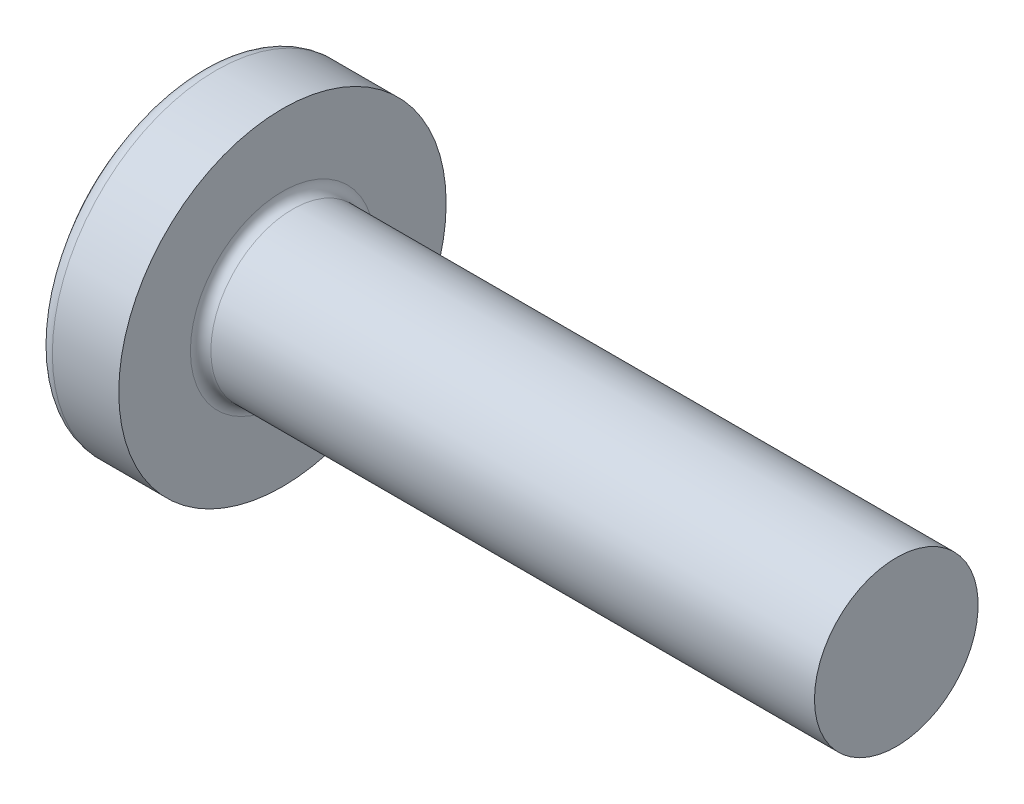
ISO-10303-21;
HEADER;
FILE_DESCRIPTION(('STEP AP214'),'2;1');
FILE_NAME('part.step','',(''),(''),'','','');
FILE_SCHEMA(('AUTOMOTIVE_DESIGN { 1 0 10303 214 1 1 1 1 }'));
ENDSEC;
DATA;
#1=APPLICATION_CONTEXT('core data for automotive mechanical design processes');
#2=APPLICATION_PROTOCOL_DEFINITION('international standard','automotive_design',2000,#1);
#3=PRODUCT_CONTEXT('',#1,'mechanical');
#4=PRODUCT('Part','Part','',(#3));
#5=PRODUCT_RELATED_PRODUCT_CATEGORY('part','',(#4));
#6=PRODUCT_DEFINITION_FORMATION('','',#4);
#7=PRODUCT_DEFINITION_CONTEXT('part definition',#1,'design');
#8=PRODUCT_DEFINITION('design','',#6,#7);
#9=PRODUCT_DEFINITION_SHAPE('','',#8);
#10=(LENGTH_UNIT() NAMED_UNIT(*) SI_UNIT(.MILLI.,.METRE.));
#11=(NAMED_UNIT(*) PLANE_ANGLE_UNIT() SI_UNIT($,.RADIAN.));
#12=(NAMED_UNIT(*) SI_UNIT($,.STERADIAN.) SOLID_ANGLE_UNIT());
#13=UNCERTAINTY_MEASURE_WITH_UNIT(LENGTH_MEASURE(1.E-05),#10,'distance_accuracy_value','');
#14=(GEOMETRIC_REPRESENTATION_CONTEXT(3) GLOBAL_UNCERTAINTY_ASSIGNED_CONTEXT((#13)) GLOBAL_UNIT_ASSIGNED_CONTEXT((#10,
#11,#12)) REPRESENTATION_CONTEXT('',''));
#15=CARTESIAN_POINT('',(0.,0.,0.));
#16=DIRECTION('',(0.,0.,1.));
#17=DIRECTION('',(1.,0.,0.));
#18=AXIS2_PLACEMENT_3D('',#15,#16,#17);
#19=CARTESIAN_POINT('',(2.5,0.,0.));
#20=DIRECTION('',(-1.,0.,0.));
#21=DIRECTION('',(0.,1.,0.));
#22=AXIS2_PLACEMENT_3D('',#19,#20,#21);
#23=SPHERICAL_SURFACE('',#22,2.5);
#24=CARTESIAN_POINT('',(0.532633828839689,0.,0.));
#25=DIRECTION('',(-1.,0.,0.));
#26=DIRECTION('',(0.,0.,1.));
#27=AXIS2_PLACEMENT_3D('',#24,#25,#26);
#28=CIRCLE('',#27,1.54255319148936);
#29=CARTESIAN_POINT('',(0.532633828839689,0.,1.54255319148936));
#30=VERTEX_POINT('',#29);
#31=EDGE_CURVE('E237',#30,#30,#28,.T.);
#32=ORIENTED_EDGE('',*,*,#31,.T.);
#33=EDGE_LOOP('',(#32));
#34=FACE_BOUND('',#33,.T.);
#35=CARTESIAN_POINT('',(0.0348536438778153,0.,0.));
#36=DIRECTION('',(1.,0.,0.));
#37=DIRECTION('',(0.,0.,-1.));
#38=AXIS2_PLACEMENT_3D('',#35,#36,#37);
#39=CIRCLE('',#38,0.415996926548163);
#40=CARTESIAN_POINT('',(0.0348536438778156,-0.239999999999999,-0.339784406495528));
#41=VERTEX_POINT('',#40);
#42=CARTESIAN_POINT('',(0.0348536438778153,-0.339784406495527,-0.24));
#43=VERTEX_POINT('',#42);
#44=EDGE_CURVE('E373',#41,#43,#39,.F.);
#45=ORIENTED_EDGE('',*,*,#44,.F.);
#46=CARTESIAN_POINT('',(2.5,-0.24,0.));
#47=DIRECTION('',(0.,1.,0.));
#48=DIRECTION('',(0.,0.,1.));
#49=AXIS2_PLACEMENT_3D('',#46,#47,#48);
#50=CIRCLE('',#49,2.48845333490504);
#51=CARTESIAN_POINT('',(0.12361367782094,-0.239999999999997,-0.738368504041365));
#52=VERTEX_POINT('',#51);
#53=EDGE_CURVE('E299',#52,#41,#50,.T.);
#54=ORIENTED_EDGE('',*,*,#53,.F.);
#55=CARTESIAN_POINT('',(2.32172308413752,0.,0.357568235162189));
#56=DIRECTION('',(0.446197753347436,0.,-0.894934391398443));
#57=DIRECTION('',(-0.894934391398443,0.,-0.446197753347436));
#58=AXIS2_PLACEMENT_3D('',#55,#56,#57);
#59=CIRCLE('',#58,2.46786594013402);
#60=CARTESIAN_POINT('',(0.12361367782094,0.240000000000003,-0.738368504041363));
#61=VERTEX_POINT('',#60);
#62=EDGE_CURVE('E271',#52,#61,#59,.T.);
#63=ORIENTED_EDGE('',*,*,#62,.T.);
#64=CARTESIAN_POINT('',(2.5,0.24,0.));
#65=DIRECTION('',(0.,-1.,0.));
#66=DIRECTION('',(0.,0.,-1.));
#67=AXIS2_PLACEMENT_3D('',#64,#65,#66);
#68=CIRCLE('',#67,2.48845333490504);
#69=CARTESIAN_POINT('',(0.0348536438778155,0.240000000000001,-0.339784406495526));
#70=VERTEX_POINT('',#69);
#71=EDGE_CURVE('E326',#70,#61,#68,.T.);
#72=ORIENTED_EDGE('',*,*,#71,.F.);
#73=CARTESIAN_POINT('',(0.0348536438778153,0.339784406495525,-0.24));
#74=VERTEX_POINT('',#73);
#75=EDGE_CURVE('E392',#74,#70,#39,.F.);
#76=ORIENTED_EDGE('',*,*,#75,.F.);
#77=CARTESIAN_POINT('',(2.5,0.,-0.24));
#78=DIRECTION('',(0.,0.,1.));
#79=DIRECTION('',(1.,0.,0.));
#80=AXIS2_PLACEMENT_3D('',#77,#78,#79);
#81=CIRCLE('',#80,2.48845333490504);
#82=CARTESIAN_POINT('',(0.12361367782094,0.738368504041364,-0.24));
#83=VERTEX_POINT('',#82);
#84=EDGE_CURVE('E265',#83,#74,#81,.T.);
#85=ORIENTED_EDGE('',*,*,#84,.F.);
#86=CARTESIAN_POINT('',(2.32172308413752,-0.357568235162189,0.));
#87=DIRECTION('',(0.446197753347436,0.894934391398443,0.));
#88=DIRECTION('',(-0.894934391398443,0.446197753347436,0.));
#89=AXIS2_PLACEMENT_3D('',#86,#87,#88);
#90=CIRCLE('',#89,2.46786594013402);
#91=CARTESIAN_POINT('',(0.12361367782094,0.738368504041364,0.24));
#92=VERTEX_POINT('',#91);
#93=EDGE_CURVE('E268',#83,#92,#90,.T.);
#94=ORIENTED_EDGE('',*,*,#93,.T.);
#95=CARTESIAN_POINT('',(2.5,0.,0.24));
#96=DIRECTION('',(0.,0.,-1.));
#97=DIRECTION('',(0.,1.,0.));
#98=AXIS2_PLACEMENT_3D('',#95,#96,#97);
#99=CIRCLE('',#98,2.48845333490504);
#100=CARTESIAN_POINT('',(0.0348536438778153,0.339784406495525,0.24));
#101=VERTEX_POINT('',#100);
#102=EDGE_CURVE('E261',#101,#92,#99,.T.);
#103=ORIENTED_EDGE('',*,*,#102,.F.);
#104=CARTESIAN_POINT('',(0.0348536438778156,0.239999999999999,0.339784406495528));
#105=VERTEX_POINT('',#104);
#106=EDGE_CURVE('E391',#105,#101,#39,.F.);
#107=ORIENTED_EDGE('',*,*,#106,.F.);
#108=CARTESIAN_POINT('',(0.12361367782094,0.239999999999997,0.738368504041365));
#109=VERTEX_POINT('',#108);
#110=EDGE_CURVE('E281',#109,#105,#68,.T.);
#111=ORIENTED_EDGE('',*,*,#110,.F.);
#112=CARTESIAN_POINT('',(2.32172308413752,0.,-0.357568235162189));
#113=DIRECTION('',(0.446197753347436,0.,0.894934391398443));
#114=DIRECTION('',(0.894934391398443,0.,-0.446197753347436));
#115=AXIS2_PLACEMENT_3D('',#112,#113,#114);
#116=CIRCLE('',#115,2.46786594013402);
#117=CARTESIAN_POINT('',(0.12361367782094,-0.240000000000002,0.738368504041363));
#118=VERTEX_POINT('',#117);
#119=EDGE_CURVE('E48',#109,#118,#116,.T.);
#120=ORIENTED_EDGE('',*,*,#119,.T.);
#121=CARTESIAN_POINT('',(0.0348536438778154,-0.240000000000001,0.339784406495526));
#122=VERTEX_POINT('',#121);
#123=EDGE_CURVE('E278',#122,#118,#50,.T.);
#124=ORIENTED_EDGE('',*,*,#123,.F.);
#125=CARTESIAN_POINT('',(0.0348536438778153,-0.339784406495527,0.24));
#126=VERTEX_POINT('',#125);
#127=EDGE_CURVE('E427',#126,#122,#39,.F.);
#128=ORIENTED_EDGE('',*,*,#127,.F.);
#129=CARTESIAN_POINT('',(0.123613677820939,-0.738368504041364,0.24));
#130=VERTEX_POINT('',#129);
#131=EDGE_CURVE('E262',#130,#126,#99,.T.);
#132=ORIENTED_EDGE('',*,*,#131,.F.);
#133=CARTESIAN_POINT('',(2.32172308413752,0.357568235162189,0.));
#134=DIRECTION('',(0.446197753347436,-0.894934391398443,0.));
#135=DIRECTION('',(0.894934391398443,0.446197753347436,0.));
#136=AXIS2_PLACEMENT_3D('',#133,#134,#135);
#137=CIRCLE('',#136,2.46786594013402);
#138=CARTESIAN_POINT('',(0.123613677820939,-0.738368504041364,-0.24));
#139=VERTEX_POINT('',#138);
#140=EDGE_CURVE('E258',#130,#139,#137,.T.);
#141=ORIENTED_EDGE('',*,*,#140,.T.);
#142=EDGE_CURVE('E63',#43,#139,#81,.T.);
#143=ORIENTED_EDGE('',*,*,#142,.F.);
#144=EDGE_LOOP('',(#45,#54,#63,#72,#76,#85,#94,#103,#107,#111,#120,#124,#128,#132,#141,#143));
#145=FACE_BOUND('',#144,.T.);
#146=ADVANCED_FACE('F35',(#34,#145),#23,.T.);
#147=CARTESIAN_POINT('',(0.,0.8,-0.24));
#148=DIRECTION('',(0.,0.,1.));
#149=DIRECTION('',(1.,0.,0.));
#150=AXIS2_PLACEMENT_3D('',#147,#148,#149);
#151=PLANE('',#150);
#152=ORIENTED_EDGE('',*,*,#84,.T.);
#153=CARTESIAN_POINT('',(-0.629305626090504,0.395285037112982,-0.24));
#154=CARTESIAN_POINT('',(-0.502245440869323,0.384885761504805,-0.24));
#155=CARTESIAN_POINT('',(-0.375193303991233,0.374386041200533,-0.24));
#156=CARTESIAN_POINT('',(-0.121109362358297,0.353102592236972,-0.24));
#157=CARTESIAN_POINT('',(0.00592244174753994,0.342318855839852,-0.24));
#158=CARTESIAN_POINT('',(0.259954553132912,0.320384813741064,-0.24));
#159=CARTESIAN_POINT('',(0.386954860411928,0.309234508033358,-0.24));
#160=CARTESIAN_POINT('',(0.640908035068628,0.286428502217992,-0.24));
#161=CARTESIAN_POINT('',(0.767860903211904,0.274772810656204,-0.24));
#162=CARTESIAN_POINT('',(1.02740505364566,0.250195813655409,-0.24));
#163=CARTESIAN_POINT('',(1.15999322223085,0.237241167273189,-0.24));
#164=CARTESIAN_POINT('',(1.35878055743685,0.216851377657758,-0.24));
#165=CARTESIAN_POINT('',(1.42502853887618,0.209894992147929,-0.24));
#166=CARTESIAN_POINT('',(1.55747716895958,0.195536747895865,-0.24));
#167=CARTESIAN_POINT('',(1.62367781680682,0.188134881824936,-0.24));
#168=CARTESIAN_POINT('',(1.68984631429491,0.180447253558893,-0.24));
#169=B_SPLINE_CURVE_WITH_KNOTS('',3,(#153,#154,#155,#156,#157,#158,#159,#160,#161,#162,#163,
#164,#165,#166,#167,#168),.UNSPECIFIED.,.F.,.F.,(4,2,2,2,2,2,2,4),(0.,0.382455333743983,
0.764921098031735,1.14738686861956,1.52984617438513,1.92950045825535,2.1293357867965,
2.32917440376972),.UNSPECIFIED.);
#170=CARTESIAN_POINT('',(0.9,0.262259890185289,-0.24));
#171=VERTEX_POINT('',#170);
#172=EDGE_CURVE('E413',#74,#171,#169,.T.);
#173=ORIENTED_EDGE('',*,*,#172,.T.);
#174=DIRECTION('',(0.,1.,0.));
#175=VECTOR('',#174,1.);
#176=CARTESIAN_POINT('',(0.9,-0.351276627792593,-0.24));
#177=LINE('',#176,#175);
#178=CARTESIAN_POINT('',(0.9,0.351276627792593,-0.24));
#179=VERTEX_POINT('',#178);
#180=EDGE_CURVE('E355',#171,#179,#177,.T.);
#181=ORIENTED_EDGE('',*,*,#180,.T.);
#182=DIRECTION('',(0.894934391398443,-0.446197753347436,0.));
#183=VECTOR('',#182,1.);
#184=CARTESIAN_POINT('',(0.,0.8,-0.24));
#185=LINE('',#184,#183);
#186=EDGE_CURVE('E238',#83,#179,#185,.T.);
#187=ORIENTED_EDGE('',*,*,#186,.F.);
#188=EDGE_LOOP('',(#152,#173,#181,#187));
#189=FACE_BOUND('',#188,.T.);
#190=ADVANCED_FACE('F193',(#189),#151,.T.);
#191=CARTESIAN_POINT('',(0.9,-0.351276627792593,-0.24));
#192=VERTEX_POINT('',#191);
#193=CARTESIAN_POINT('',(0.9,-0.262259890185289,-0.24));
#194=VERTEX_POINT('',#193);
#195=EDGE_CURVE('E246',#192,#194,#177,.T.);
#196=ORIENTED_EDGE('',*,*,#195,.T.);
#197=CARTESIAN_POINT('',(-0.629305626090504,-0.395285037112982,-0.24));
#198=CARTESIAN_POINT('',(-0.502245440869323,-0.384885761504805,-0.24));
#199=CARTESIAN_POINT('',(-0.375193303991233,-0.374386041200533,-0.24));
#200=CARTESIAN_POINT('',(-0.121109362358297,-0.353102592236972,-0.24));
#201=CARTESIAN_POINT('',(0.00592244174753997,-0.342318855839851,-0.24));
#202=CARTESIAN_POINT('',(0.259954553132912,-0.320384813741064,-0.24));
#203=CARTESIAN_POINT('',(0.386954860411928,-0.309234508033358,-0.24));
#204=CARTESIAN_POINT('',(0.640908035068629,-0.286428502217992,-0.24));
#205=CARTESIAN_POINT('',(0.767860903211904,-0.274772810656204,-0.24));
#206=CARTESIAN_POINT('',(1.02740505364566,-0.25019581365541,-0.24));
#207=CARTESIAN_POINT('',(1.15999322223084,-0.23724116727319,-0.24));
#208=CARTESIAN_POINT('',(1.35878055743684,-0.21685137765776,-0.24));
#209=CARTESIAN_POINT('',(1.42502853887616,-0.209894992147931,-0.24));
#210=CARTESIAN_POINT('',(1.55747716895955,-0.195536747895868,-0.24));
#211=CARTESIAN_POINT('',(1.62367781680679,-0.188134881824939,-0.24));
#212=CARTESIAN_POINT('',(1.68984631429488,-0.180447253558897,-0.24));
#213=B_SPLINE_CURVE_WITH_KNOTS('',3,(#197,#198,#199,#200,#201,#202,#203,#204,#205,#206,#207,
#208,#209,#210,#211,#212),.UNSPECIFIED.,.F.,.F.,(4,2,2,2,2,2,2,4),(0.,0.382455333743982,
0.764921098031735,1.14738686861956,1.52984617438513,1.92950045825533,2.12933578679647,
2.32917440376969),.UNSPECIFIED.);
#214=EDGE_CURVE('E390',#194,#43,#213,.F.);
#215=ORIENTED_EDGE('',*,*,#214,.T.);
#216=ORIENTED_EDGE('',*,*,#142,.T.);
#217=DIRECTION('',(0.894934391398443,0.446197753347436,0.));
#218=VECTOR('',#217,1.);
#219=CARTESIAN_POINT('',(0.,-0.8,-0.24));
#220=LINE('',#219,#218);
#221=EDGE_CURVE('E329',#139,#192,#220,.T.);
#222=ORIENTED_EDGE('',*,*,#221,.T.);
#223=EDGE_LOOP('',(#196,#215,#216,#222));
#224=FACE_BOUND('',#223,.T.);
#225=ADVANCED_FACE('F199',(#224),#151,.T.);
#226=CARTESIAN_POINT('',(0.,-0.799999999999999,0.24));
#227=DIRECTION('',(0.,0.,-1.));
#228=DIRECTION('',(0.,1.,0.));
#229=AXIS2_PLACEMENT_3D('',#226,#227,#228);
#230=PLANE('',#229);
#231=DIRECTION('',(0.,-1.,0.));
#232=VECTOR('',#231,1.);
#233=CARTESIAN_POINT('',(0.9,0.351276627792594,0.24));
#234=LINE('',#233,#232);
#235=CARTESIAN_POINT('',(0.9,0.351276627792593,0.24));
#236=VERTEX_POINT('',#235);
#237=CARTESIAN_POINT('',(0.9,0.262259890185289,0.24));
#238=VERTEX_POINT('',#237);
#239=EDGE_CURVE('E338',#236,#238,#234,.T.);
#240=ORIENTED_EDGE('',*,*,#239,.T.);
#241=CARTESIAN_POINT('',(-0.629305630567792,0.395285037479254,0.24));
#242=CARTESIAN_POINT('',(-0.502245444906562,0.384885761837513,0.24));
#243=CARTESIAN_POINT('',(-0.37519330758842,0.374386041499475,0.24));
#244=CARTESIAN_POINT('',(-0.121109365075988,0.353102592467066,0.24));
#245=CARTESIAN_POINT('',(0.00592243946929239,0.342318856034865,0.24));
#246=CARTESIAN_POINT('',(0.259954552394605,0.320384813806507,0.24));
#247=CARTESIAN_POINT('',(0.386954860773954,0.309234508002403,0.24));
#248=CARTESIAN_POINT('',(0.640908037631128,0.28642850198631,0.24));
#249=CARTESIAN_POINT('',(0.767860906874543,0.274772810320191,0.24));
#250=CARTESIAN_POINT('',(1.02740503497566,0.250195815411898,0.24));
#251=CARTESIAN_POINT('',(1.15999318014167,0.237241171372313,0.24));
#252=CARTESIAN_POINT('',(1.3587804802603,0.216851385682779,0.24));
#253=CARTESIAN_POINT('',(1.42502845000986,0.209895001550342,0.24));
#254=CARTESIAN_POINT('',(1.55747705673954,0.195536760284762,0.24));
#255=CARTESIAN_POINT('',(1.62367769292282,0.188134895822935,0.24));
#256=CARTESIAN_POINT('',(1.68984617876655,0.180447269328959,0.24));
#257=B_SPLINE_CURVE_WITH_KNOTS('',3,(#241,#242,#243,#244,#245,#246,#247,#248,#249,#250,#251,
#252,#253,#254,#255,#256),.UNSPECIFIED.,.F.,.F.,(4,2,2,2,2,2,2,4),(0.,0.382455335067977,
0.764921100678223,1.14738687457974,1.52984618366023,1.92950039692504,2.12933569015823,
2.32917427182048),.UNSPECIFIED.);
#258=EDGE_CURVE('E665',#238,#101,#257,.F.);
#259=ORIENTED_EDGE('',*,*,#258,.T.);
#260=ORIENTED_EDGE('',*,*,#102,.T.);
#261=DIRECTION('',(0.894934391398443,-0.446197753347436,0.));
#262=VECTOR('',#261,1.);
#263=CARTESIAN_POINT('',(0.,0.8,0.24));
#264=LINE('',#263,#262);
#265=EDGE_CURVE('E243',#92,#236,#264,.T.);
#266=ORIENTED_EDGE('',*,*,#265,.T.);
#267=EDGE_LOOP('',(#240,#259,#260,#266));
#268=FACE_BOUND('',#267,.T.);
#269=ADVANCED_FACE('F409',(#268),#230,.T.);
#270=ORIENTED_EDGE('',*,*,#131,.T.);
#271=CARTESIAN_POINT('',(-0.629305630567792,-0.395285037479254,0.24));
#272=CARTESIAN_POINT('',(-0.502245444906562,-0.384885761837513,0.24));
#273=CARTESIAN_POINT('',(-0.37519330758842,-0.374386041499475,0.24));
#274=CARTESIAN_POINT('',(-0.121109365075988,-0.353102592467066,0.24));
#275=CARTESIAN_POINT('',(0.00592243946929239,-0.342318856034865,0.24));
#276=CARTESIAN_POINT('',(0.259954552394605,-0.320384813806507,0.24));
#277=CARTESIAN_POINT('',(0.386954860773954,-0.309234508002403,0.24));
#278=CARTESIAN_POINT('',(0.640908037631127,-0.28642850198631,0.24));
#279=CARTESIAN_POINT('',(0.767860906874543,-0.274772810320191,0.24));
#280=CARTESIAN_POINT('',(1.02740503497566,-0.250195815411898,0.24));
#281=CARTESIAN_POINT('',(1.15999318014167,-0.237241171372313,0.24));
#282=CARTESIAN_POINT('',(1.35878048026031,-0.216851385682778,0.24));
#283=CARTESIAN_POINT('',(1.42502845000988,-0.20989500155034,0.24));
#284=CARTESIAN_POINT('',(1.55747705673956,-0.195536760284761,0.24));
#285=CARTESIAN_POINT('',(1.62367769292284,-0.188134895822933,0.24));
#286=CARTESIAN_POINT('',(1.68984617876656,-0.180447269328957,0.24));
#287=B_SPLINE_CURVE_WITH_KNOTS('',3,(#271,#272,#273,#274,#275,#276,#277,#278,#279,#280,#281,
#282,#283,#284,#285,#286),.UNSPECIFIED.,.F.,.F.,(4,2,2,2,2,2,2,4),(0.,0.382455335067977,
0.764921100678223,1.14738687457974,1.52984618366023,1.92950039692505,2.12933569015824,
2.3291742718205),.UNSPECIFIED.);
#288=CARTESIAN_POINT('',(0.9,-0.262259890185289,0.24));
#289=VERTEX_POINT('',#288);
#290=EDGE_CURVE('E428',#126,#289,#287,.T.);
#291=ORIENTED_EDGE('',*,*,#290,.T.);
#292=CARTESIAN_POINT('',(0.9,-0.351276627792593,0.24));
#293=VERTEX_POINT('',#292);
#294=EDGE_CURVE('E340',#289,#293,#234,.T.);
#295=ORIENTED_EDGE('',*,*,#294,.T.);
#296=DIRECTION('',(0.894934391398443,0.446197753347436,0.));
#297=VECTOR('',#296,1.);
#298=CARTESIAN_POINT('',(0.,-0.8,0.24));
#299=LINE('',#298,#297);
#300=EDGE_CURVE('E331',#130,#293,#299,.T.);
#301=ORIENTED_EDGE('',*,*,#300,.F.);
#302=EDGE_LOOP('',(#270,#291,#295,#301));
#303=FACE_BOUND('',#302,.T.);
#304=ADVANCED_FACE('F513',(#303),#230,.T.);
#305=CARTESIAN_POINT('',(0.,0.8,0.24));
#306=DIRECTION('',(0.446197753347436,0.894934391398443,0.));
#307=DIRECTION('',(-0.894934391398443,0.446197753347436,0.));
#308=AXIS2_PLACEMENT_3D('',#305,#306,#307);
#309=PLANE('',#308);
#310=CARTESIAN_POINT('',(1.51667990224654,0.0438114218941496,0.));
#311=DIRECTION('',(0.446197753347436,0.894934391398443,0.));
#312=DIRECTION('',(-0.894934391398443,0.446197753347436,0.));
#313=AXIS2_PLACEMENT_3D('',#310,#311,#312);
#314=ELLIPSE('',#313,0.700087658673246,0.309289972496479);
#315=CARTESIAN_POINT('',(0.9,0.351276627792594,0.0546349775021752));
#316=VERTEX_POINT('',#315);
#317=CARTESIAN_POINT('',(0.9,0.351276627792594,-0.0546349775021753));
#318=VERTEX_POINT('',#317);
#319=EDGE_CURVE('E304',#316,#318,#314,.F.);
#320=ORIENTED_EDGE('',*,*,#319,.F.);
#321=DIRECTION('',(0.,0.,-1.));
#322=VECTOR('',#321,1.);
#323=CARTESIAN_POINT('',(0.9,0.351276627792594,0.24));
#324=LINE('',#323,#322);
#325=EDGE_CURVE('E341',#236,#316,#324,.T.);
#326=ORIENTED_EDGE('',*,*,#325,.F.);
#327=ORIENTED_EDGE('',*,*,#265,.F.);
#328=ORIENTED_EDGE('',*,*,#93,.F.);
#329=ORIENTED_EDGE('',*,*,#186,.T.);
#330=EDGE_CURVE('E343',#318,#179,#324,.T.);
#331=ORIENTED_EDGE('',*,*,#330,.F.);
#332=EDGE_LOOP('',(#320,#326,#327,#328,#329,#331));
#333=FACE_BOUND('',#332,.T.);
#334=ADVANCED_FACE('F407',(#333),#309,.F.);
#335=CARTESIAN_POINT('',(0.9,-0.351276627792593,-0.24));
#336=DIRECTION('',(0.446197753347436,-0.894934391398443,0.));
#337=DIRECTION('',(0.894934391398443,0.446197753347436,0.));
#338=AXIS2_PLACEMENT_3D('',#335,#336,#337);
#339=PLANE('',#338);
#340=CARTESIAN_POINT('',(1.51667990224654,-0.0438114218941494,0.));
#341=DIRECTION('',(0.446197753347436,-0.894934391398443,0.));
#342=DIRECTION('',(-0.894934391398443,-0.446197753347436,0.));
#343=AXIS2_PLACEMENT_3D('',#340,#341,#342);
#344=ELLIPSE('',#343,0.700087658673246,0.30928997249648);
#345=CARTESIAN_POINT('',(0.9,-0.351276627792594,-0.054634977502177));
#346=VERTEX_POINT('',#345);
#347=CARTESIAN_POINT('',(0.9,-0.351276627792594,0.0546349775021769));
#348=VERTEX_POINT('',#347);
#349=EDGE_CURVE('E667',#346,#348,#344,.F.);
#350=ORIENTED_EDGE('',*,*,#349,.F.);
#351=DIRECTION('',(0.,0.,1.));
#352=VECTOR('',#351,1.);
#353=CARTESIAN_POINT('',(0.9,-0.351276627792593,-0.24));
#354=LINE('',#353,#352);
#355=EDGE_CURVE('E334',#192,#346,#354,.T.);
#356=ORIENTED_EDGE('',*,*,#355,.F.);
#357=ORIENTED_EDGE('',*,*,#221,.F.);
#358=ORIENTED_EDGE('',*,*,#140,.F.);
#359=ORIENTED_EDGE('',*,*,#300,.T.);
#360=EDGE_CURVE('E337',#348,#293,#354,.T.);
#361=ORIENTED_EDGE('',*,*,#360,.F.);
#362=EDGE_LOOP('',(#350,#356,#357,#358,#359,#361));
#363=FACE_BOUND('',#362,.T.);
#364=ADVANCED_FACE('F500',(#363),#339,.F.);
#365=CARTESIAN_POINT('',(0.9,0.351276627792593,-0.24));
#366=DIRECTION('',(-1.,0.,0.));
#367=DIRECTION('',(0.,0.,1.));
#368=AXIS2_PLACEMENT_3D('',#365,#366,#367);
#369=PLANE('',#368);
#370=DIRECTION('',(0.,1.,0.));
#371=VECTOR('',#370,1.);
#372=CARTESIAN_POINT('',(0.9,-0.240000000000001,0.351276627792593));
#373=LINE('',#372,#371);
#374=CARTESIAN_POINT('',(0.9,-0.240000000000001,0.351276627792593));
#375=VERTEX_POINT('',#374);
#376=CARTESIAN_POINT('',(0.9,-0.0546349775021797,0.351276627792593));
#377=VERTEX_POINT('',#376);
#378=EDGE_CURVE('E319',#375,#377,#373,.T.);
#379=ORIENTED_EDGE('',*,*,#378,.T.);
#380=CARTESIAN_POINT('',(0.9,0.,0.));
#381=DIRECTION('',(-1.,0.,0.));
#382=DIRECTION('',(0.,0.,1.));
#383=AXIS2_PLACEMENT_3D('',#380,#381,#382);
#384=CIRCLE('',#383,0.3555);
#385=CARTESIAN_POINT('',(0.9,-0.240000000000001,0.262259890185289));
#386=VERTEX_POINT('',#385);
#387=EDGE_CURVE('E693',#386,#377,#384,.T.);
#388=ORIENTED_EDGE('',*,*,#387,.F.);
#389=DIRECTION('',(0.,0.,-1.));
#390=VECTOR('',#389,1.);
#391=CARTESIAN_POINT('',(0.9,-0.240000000000001,0.351276627792593));
#392=LINE('',#391,#390);
#393=EDGE_CURVE('E315',#375,#386,#392,.T.);
#394=ORIENTED_EDGE('',*,*,#393,.F.);
#395=EDGE_LOOP('',(#379,#388,#394));
#396=FACE_BOUND('',#395,.T.);
#397=ADVANCED_FACE('F493',(#396),#369,.T.);
#398=ORIENTED_EDGE('',*,*,#294,.F.);
#399=EDGE_CURVE('E698',#348,#289,#384,.T.);
#400=ORIENTED_EDGE('',*,*,#399,.F.);
#401=ORIENTED_EDGE('',*,*,#360,.T.);
#402=EDGE_LOOP('',(#398,#400,#401));
#403=FACE_BOUND('',#402,.T.);
#404=ADVANCED_FACE('F486',(#403),#369,.T.);
#405=ORIENTED_EDGE('',*,*,#355,.T.);
#406=EDGE_CURVE('E384',#194,#346,#384,.T.);
#407=ORIENTED_EDGE('',*,*,#406,.F.);
#408=ORIENTED_EDGE('',*,*,#195,.F.);
#409=EDGE_LOOP('',(#405,#407,#408));
#410=FACE_BOUND('',#409,.T.);
#411=ADVANCED_FACE('F480',(#410),#369,.T.);
#412=CARTESIAN_POINT('',(0.9,-0.239999999999999,-0.262259890185289));
#413=VERTEX_POINT('',#412);
#414=CARTESIAN_POINT('',(0.9,-0.239999999999999,-0.351276627792594));
#415=VERTEX_POINT('',#414);
#416=EDGE_CURVE('E318',#413,#415,#392,.T.);
#417=ORIENTED_EDGE('',*,*,#416,.F.);
#418=CARTESIAN_POINT('',(0.9,-0.0546349775021794,-0.351276627792594));
#419=VERTEX_POINT('',#418);
#420=EDGE_CURVE('E55',#419,#413,#384,.T.);
#421=ORIENTED_EDGE('',*,*,#420,.F.);
#422=DIRECTION('',(0.,-1.,0.));
#423=VECTOR('',#422,1.);
#424=CARTESIAN_POINT('',(0.9,0.240000000000001,-0.351276627792592));
#425=LINE('',#424,#423);
#426=EDGE_CURVE('E314',#419,#415,#425,.T.);
#427=ORIENTED_EDGE('',*,*,#426,.T.);
#428=EDGE_LOOP('',(#417,#421,#427));
#429=FACE_BOUND('',#428,.T.);
#430=ADVANCED_FACE('F379',(#429),#369,.T.);
#431=CARTESIAN_POINT('',(0.9,0.240000000000001,-0.351276627792592));
#432=VERTEX_POINT('',#431);
#433=CARTESIAN_POINT('',(0.9,0.054634977502182,-0.351276627792593));
#434=VERTEX_POINT('',#433);
#435=EDGE_CURVE('E311',#432,#434,#425,.T.);
#436=ORIENTED_EDGE('',*,*,#435,.T.);
#437=CARTESIAN_POINT('',(0.9,0.240000000000001,-0.262259890185289));
#438=VERTEX_POINT('',#437);
#439=EDGE_CURVE('E383',#438,#434,#384,.T.);
#440=ORIENTED_EDGE('',*,*,#439,.F.);
#441=DIRECTION('',(0.,0.,1.));
#442=VECTOR('',#441,1.);
#443=CARTESIAN_POINT('',(0.9,0.240000000000001,-0.351276627792592));
#444=LINE('',#443,#442);
#445=EDGE_CURVE('E323',#432,#438,#444,.T.);
#446=ORIENTED_EDGE('',*,*,#445,.F.);
#447=EDGE_LOOP('',(#436,#440,#446));
#448=FACE_BOUND('',#447,.T.);
#449=ADVANCED_FACE('F468',(#448),#369,.T.);
#450=ORIENTED_EDGE('',*,*,#180,.F.);
#451=EDGE_CURVE('E682',#318,#171,#384,.T.);
#452=ORIENTED_EDGE('',*,*,#451,.F.);
#453=ORIENTED_EDGE('',*,*,#330,.T.);
#454=EDGE_LOOP('',(#450,#452,#453));
#455=FACE_BOUND('',#454,.T.);
#456=ADVANCED_FACE('F461',(#455),#369,.T.);
#457=ORIENTED_EDGE('',*,*,#325,.T.);
#458=EDGE_CURVE('E684',#238,#316,#384,.T.);
#459=ORIENTED_EDGE('',*,*,#458,.F.);
#460=ORIENTED_EDGE('',*,*,#239,.F.);
#461=EDGE_LOOP('',(#457,#459,#460));
#462=FACE_BOUND('',#461,.T.);
#463=ADVANCED_FACE('F455',(#462),#369,.T.);
#464=CARTESIAN_POINT('',(0.,0.239999999999997,0.8));
#465=DIRECTION('',(0.,-1.,0.));
#466=DIRECTION('',(1.,0.,0.));
#467=AXIS2_PLACEMENT_3D('',#464,#465,#466);
#468=PLANE('',#467);
#469=ORIENTED_EDGE('',*,*,#110,.T.);
#470=CARTESIAN_POINT('',(-0.629305630567792,0.239999999999999,0.395285037479255));
#471=CARTESIAN_POINT('',(-0.502245444906562,0.239999999999999,0.384885761837514));
#472=CARTESIAN_POINT('',(-0.37519330758842,0.239999999999999,0.374386041499476));
#473=CARTESIAN_POINT('',(-0.121109365075988,0.239999999999999,0.353102592467067));
#474=CARTESIAN_POINT('',(0.00592243946929253,0.239999999999999,0.342318856034866));
#475=CARTESIAN_POINT('',(0.259954552394605,0.239999999999999,0.320384813806507));
#476=CARTESIAN_POINT('',(0.386954860773954,0.239999999999999,0.309234508002404));
#477=CARTESIAN_POINT('',(0.640908037631128,0.239999999999999,0.286428501986311));
#478=CARTESIAN_POINT('',(0.767860906874543,0.239999999999999,0.274772810320191));
#479=CARTESIAN_POINT('',(1.02740503497566,0.239999999999999,0.250195815411899));
#480=CARTESIAN_POINT('',(1.15999318014167,0.239999999999999,0.237241171372314));
#481=CARTESIAN_POINT('',(1.3587804802603,0.239999999999999,0.216851385682779));
#482=CARTESIAN_POINT('',(1.42502845000987,0.239999999999999,0.209895001550342));
#483=CARTESIAN_POINT('',(1.55747705673954,0.239999999999999,0.195536760284763));
#484=CARTESIAN_POINT('',(1.62367769292282,0.239999999999999,0.188134895822936));
#485=CARTESIAN_POINT('',(1.68984617876655,0.239999999999999,0.180447269328959));
#486=B_SPLINE_CURVE_WITH_KNOTS('',3,(#470,#471,#472,#473,#474,#475,#476,#477,#478,#479,#480,
#481,#482,#483,#484,#485),.UNSPECIFIED.,.F.,.F.,(4,2,2,2,2,2,2,4),(0.,0.382455335067977,
0.764921100678223,1.14738687457974,1.52984618366023,1.92950039692504,2.12933569015823,
2.32917427182049),.UNSPECIFIED.);
#487=CARTESIAN_POINT('',(0.9,0.239999999999999,0.26225989018529));
#488=VERTEX_POINT('',#487);
#489=EDGE_CURVE('E664',#105,#488,#486,.T.);
#490=ORIENTED_EDGE('',*,*,#489,.T.);
#491=CARTESIAN_POINT('',(0.9,0.239999999999999,0.351276627792594));
#492=VERTEX_POINT('',#491);
#493=EDGE_CURVE('E296',#488,#492,#444,.T.);
#494=ORIENTED_EDGE('',*,*,#493,.T.);
#495=DIRECTION('',(0.894934391398443,0.,-0.446197753347436));
#496=VECTOR('',#495,1.);
#497=CARTESIAN_POINT('',(0.,0.239999999999997,0.800000000000001));
#498=LINE('',#497,#496);
#499=EDGE_CURVE('E289',#109,#492,#498,.T.);
#500=ORIENTED_EDGE('',*,*,#499,.F.);
#501=EDGE_LOOP('',(#469,#490,#494,#500));
#502=FACE_BOUND('',#501,.T.);
#503=ADVANCED_FACE('F293',(#502),#468,.T.);
#504=CARTESIAN_POINT('',(0.,-0.239999999999997,-0.8));
#505=DIRECTION('',(0.,1.,0.));
#506=DIRECTION('',(0.,0.,1.));
#507=AXIS2_PLACEMENT_3D('',#504,#505,#506);
#508=PLANE('',#507);
#509=ORIENTED_EDGE('',*,*,#393,.T.);
#510=CARTESIAN_POINT('',(-0.629305630567792,-0.240000000000001,0.395285037479253));
#511=CARTESIAN_POINT('',(-0.502245444906562,-0.240000000000001,0.384885761837512));
#512=CARTESIAN_POINT('',(-0.37519330758842,-0.240000000000001,0.374386041499475));
#513=CARTESIAN_POINT('',(-0.121109365075989,-0.240000000000001,0.353102592467065));
#514=CARTESIAN_POINT('',(0.00592243946929218,-0.240000000000001,0.342318856034864));
#515=CARTESIAN_POINT('',(0.259954552394605,-0.240000000000001,0.320384813806506));
#516=CARTESIAN_POINT('',(0.386954860773954,-0.240000000000001,0.309234508002402));
#517=CARTESIAN_POINT('',(0.640908037631127,-0.240000000000001,0.286428501986309));
#518=CARTESIAN_POINT('',(0.767860906874543,-0.240000000000001,0.27477281032019));
#519=CARTESIAN_POINT('',(1.02740503497566,-0.240000000000001,0.250195815411897));
#520=CARTESIAN_POINT('',(1.15999318014167,-0.240000000000001,0.237241171372312));
#521=CARTESIAN_POINT('',(1.3587804802603,-0.240000000000001,0.216851385682777));
#522=CARTESIAN_POINT('',(1.42502845000987,-0.240000000000001,0.20989500155034));
#523=CARTESIAN_POINT('',(1.55747705673955,-0.240000000000001,0.195536760284761));
#524=CARTESIAN_POINT('',(1.62367769292283,-0.240000000000001,0.188134895822933));
#525=CARTESIAN_POINT('',(1.68984617876656,-0.240000000000001,0.180447269328957));
#526=B_SPLINE_CURVE_WITH_KNOTS('',3,(#510,#511,#512,#513,#514,#515,#516,#517,#518,#519,#520,
#521,#522,#523,#524,#525),.UNSPECIFIED.,.F.,.F.,(4,2,2,2,2,2,2,4),(0.,0.382455335067977,
0.764921100678223,1.14738687457974,1.52984618366023,1.92950039692505,2.12933569015823,
2.32917427182049),.UNSPECIFIED.);
#527=EDGE_CURVE('E421',#386,#122,#526,.F.);
#528=ORIENTED_EDGE('',*,*,#527,.T.);
#529=ORIENTED_EDGE('',*,*,#123,.T.);
#530=DIRECTION('',(0.894934391398443,0.,-0.446197753347436));
#531=VECTOR('',#530,1.);
#532=CARTESIAN_POINT('',(0.,-0.240000000000003,0.799999999999999));
#533=LINE('',#532,#531);
#534=EDGE_CURVE('E291',#118,#375,#533,.T.);
#535=ORIENTED_EDGE('',*,*,#534,.T.);
#536=EDGE_LOOP('',(#509,#528,#529,#535));
#537=FACE_BOUND('',#536,.T.);
#538=ADVANCED_FACE('F228',(#537),#508,.T.);
#539=CARTESIAN_POINT('',(0.,-0.240000000000003,0.799999999999999));
#540=DIRECTION('',(0.446197753347436,0.,0.894934391398443));
#541=DIRECTION('',(-0.894934391398443,0.,0.446197753347436));
#542=AXIS2_PLACEMENT_3D('',#539,#540,#541);
#543=PLANE('',#542);
#544=CARTESIAN_POINT('',(1.51667990224654,0.,0.0438114218941496));
#545=DIRECTION('',(0.446197753347436,0.,0.894934391398443));
#546=DIRECTION('',(-0.894934391398443,0.,0.446197753347436));
#547=AXIS2_PLACEMENT_3D('',#544,#545,#546);
#548=ELLIPSE('',#547,0.700087658673246,0.309289972496479);
#549=CARTESIAN_POINT('',(0.9,0.0546349775021773,0.351276627792594));
#550=VERTEX_POINT('',#549);
#551=EDGE_CURVE('E419',#377,#550,#548,.F.);
#552=ORIENTED_EDGE('',*,*,#551,.F.);
#553=ORIENTED_EDGE('',*,*,#378,.F.);
#554=ORIENTED_EDGE('',*,*,#534,.F.);
#555=ORIENTED_EDGE('',*,*,#119,.F.);
#556=ORIENTED_EDGE('',*,*,#499,.T.);
#557=EDGE_CURVE('E322',#550,#492,#373,.T.);
#558=ORIENTED_EDGE('',*,*,#557,.F.);
#559=EDGE_LOOP('',(#552,#553,#554,#555,#556,#558));
#560=FACE_BOUND('',#559,.T.);
#561=ADVANCED_FACE('F287',(#560),#543,.F.);
#562=CARTESIAN_POINT('',(0.9,0.240000000000001,-0.351276627792592));
#563=DIRECTION('',(0.446197753347436,0.,-0.894934391398443));
#564=DIRECTION('',(0.894934391398443,0.,0.446197753347436));
#565=AXIS2_PLACEMENT_3D('',#562,#563,#564);
#566=PLANE('',#565);
#567=CARTESIAN_POINT('',(1.51667990224654,0.,-0.0438114218941494));
#568=DIRECTION('',(0.446197753347436,0.,-0.894934391398443));
#569=DIRECTION('',(-0.894934391398443,0.,-0.446197753347436));
#570=AXIS2_PLACEMENT_3D('',#567,#568,#569);
#571=ELLIPSE('',#570,0.700087658673246,0.30928997249648);
#572=EDGE_CURVE('E377',#434,#419,#571,.F.);
#573=ORIENTED_EDGE('',*,*,#572,.F.);
#574=ORIENTED_EDGE('',*,*,#435,.F.);
#575=DIRECTION('',(0.894934391398443,0.,0.446197753347436));
#576=VECTOR('',#575,1.);
#577=CARTESIAN_POINT('',(0.,0.240000000000003,-0.799999999999999));
#578=LINE('',#577,#576);
#579=EDGE_CURVE('E301',#61,#432,#578,.T.);
#580=ORIENTED_EDGE('',*,*,#579,.F.);
#581=ORIENTED_EDGE('',*,*,#62,.F.);
#582=DIRECTION('',(0.894934391398443,0.,0.446197753347436));
#583=VECTOR('',#582,1.);
#584=CARTESIAN_POINT('',(0.,-0.239999999999997,-0.800000000000001));
#585=LINE('',#584,#583);
#586=EDGE_CURVE('E308',#52,#415,#585,.T.);
#587=ORIENTED_EDGE('',*,*,#586,.T.);
#588=ORIENTED_EDGE('',*,*,#426,.F.);
#589=EDGE_LOOP('',(#573,#574,#580,#581,#587,#588));
#590=FACE_BOUND('',#589,.T.);
#591=ADVANCED_FACE('F368',(#590),#566,.F.);
#592=ORIENTED_EDGE('',*,*,#445,.T.);
#593=CARTESIAN_POINT('',(-0.629305626090504,0.240000000000001,-0.395285037112981));
#594=CARTESIAN_POINT('',(-0.502245440869323,0.240000000000001,-0.384885761504804));
#595=CARTESIAN_POINT('',(-0.375193303991233,0.240000000000001,-0.374386041200532));
#596=CARTESIAN_POINT('',(-0.121109362358297,0.240000000000001,-0.353102592236971));
#597=CARTESIAN_POINT('',(0.00592244174753992,0.240000000000001,-0.342318855839851));
#598=CARTESIAN_POINT('',(0.259954553132912,0.240000000000001,-0.320384813741063));
#599=CARTESIAN_POINT('',(0.386954860411928,0.240000000000001,-0.309234508033357));
#600=CARTESIAN_POINT('',(0.640908035068628,0.240000000000001,-0.286428502217991));
#601=CARTESIAN_POINT('',(0.767860903211904,0.240000000000001,-0.274772810656203));
#602=CARTESIAN_POINT('',(1.02740505364566,0.240000000000001,-0.250195813655408));
#603=CARTESIAN_POINT('',(1.15999322223085,0.240000000000001,-0.237241167273188));
#604=CARTESIAN_POINT('',(1.35878055743686,0.240000000000001,-0.216851377657757));
#605=CARTESIAN_POINT('',(1.42502853887618,0.240000000000001,-0.209894992147928));
#606=CARTESIAN_POINT('',(1.55747716895958,0.240000000000001,-0.195536747895863));
#607=CARTESIAN_POINT('',(1.62367781680683,0.240000000000001,-0.188134881824934));
#608=CARTESIAN_POINT('',(1.68984631429491,0.240000000000001,-0.180447253558892));
#609=B_SPLINE_CURVE_WITH_KNOTS('',3,(#593,#594,#595,#596,#597,#598,#599,#600,#601,#602,#603,
#604,#605,#606,#607,#608),.UNSPECIFIED.,.F.,.F.,(4,2,2,2,2,2,2,4),(0.,0.382455333743983,
0.764921098031735,1.14738686861956,1.52984617438513,1.92950045825535,2.1293357867965,
2.32917440376973),.UNSPECIFIED.);
#610=EDGE_CURVE('E364',#438,#70,#609,.F.);
#611=ORIENTED_EDGE('',*,*,#610,.T.);
#612=ORIENTED_EDGE('',*,*,#71,.T.);
#613=ORIENTED_EDGE('',*,*,#579,.T.);
#614=EDGE_LOOP('',(#592,#611,#612,#613));
#615=FACE_BOUND('',#614,.T.);
#616=ADVANCED_FACE('F226',(#615),#468,.T.);
#617=ORIENTED_EDGE('',*,*,#53,.T.);
#618=CARTESIAN_POINT('',(-0.629305626090504,-0.239999999999999,-0.395285037112982));
#619=CARTESIAN_POINT('',(-0.502245440869323,-0.239999999999999,-0.384885761504806));
#620=CARTESIAN_POINT('',(-0.375193303991233,-0.239999999999999,-0.374386041200534));
#621=CARTESIAN_POINT('',(-0.121109362358297,-0.239999999999999,-0.353102592236972));
#622=CARTESIAN_POINT('',(0.00592244174753994,-0.239999999999999,-0.342318855839853));
#623=CARTESIAN_POINT('',(0.259954553132912,-0.239999999999999,-0.320384813741065));
#624=CARTESIAN_POINT('',(0.386954860411928,-0.239999999999999,-0.309234508033359));
#625=CARTESIAN_POINT('',(0.640908035068629,-0.239999999999999,-0.286428502217993));
#626=CARTESIAN_POINT('',(0.767860903211904,-0.239999999999999,-0.274772810656205));
#627=CARTESIAN_POINT('',(1.02740505364566,-0.239999999999999,-0.25019581365541));
#628=CARTESIAN_POINT('',(1.15999322223085,-0.239999999999999,-0.237241167273189));
#629=CARTESIAN_POINT('',(1.35878055743686,-0.239999999999999,-0.216851377657759));
#630=CARTESIAN_POINT('',(1.42502853887618,-0.239999999999999,-0.209894992147929));
#631=CARTESIAN_POINT('',(1.55747716895959,-0.239999999999999,-0.195536747895865));
#632=CARTESIAN_POINT('',(1.62367781680683,-0.239999999999999,-0.188134881824936));
#633=CARTESIAN_POINT('',(1.68984631429492,-0.239999999999999,-0.180447253558893));
#634=B_SPLINE_CURVE_WITH_KNOTS('',3,(#618,#619,#620,#621,#622,#623,#624,#625,#626,#627,#628,
#629,#630,#631,#632,#633),.UNSPECIFIED.,.F.,.F.,(4,2,2,2,2,2,2,4),(0.,0.382455333743982,
0.764921098031735,1.14738686861956,1.52984617438513,1.92950045825535,2.1293357867965,
2.32917440376973),.UNSPECIFIED.);
#635=EDGE_CURVE('E11',#41,#413,#634,.T.);
#636=ORIENTED_EDGE('',*,*,#635,.T.);
#637=ORIENTED_EDGE('',*,*,#416,.T.);
#638=ORIENTED_EDGE('',*,*,#586,.F.);
#639=EDGE_LOOP('',(#617,#636,#637,#638));
#640=FACE_BOUND('',#639,.T.);
#641=ADVANCED_FACE('F221',(#640),#508,.T.);
#642=CARTESIAN_POINT('',(-25.4,0.,0.));
#643=DIRECTION('',(-1.,0.,0.));
#644=DIRECTION('',(0.,0.,1.));
#645=AXIS2_PLACEMENT_3D('',#642,#643,#644);
#646=CYLINDRICAL_SURFACE('',#645,0.8);
#647=CARTESIAN_POINT('',(1.4,0.,0.));
#648=DIRECTION('',(-1.,0.,0.));
#649=DIRECTION('',(0.,0.,1.));
#650=AXIS2_PLACEMENT_3D('',#647,#648,#649);
#651=CIRCLE('',#650,0.8);
#652=CARTESIAN_POINT('',(1.4,0.,0.8));
#653=VERTEX_POINT('',#652);
#654=EDGE_CURVE('E232',#653,#653,#651,.F.);
#655=ORIENTED_EDGE('',*,*,#654,.T.);
#656=EDGE_LOOP('',(#655));
#657=FACE_BOUND('',#656,.T.);
#658=CARTESIAN_POINT('',(7.3,0.,0.));
#659=DIRECTION('',(-1.,0.,0.));
#660=DIRECTION('',(0.,0.,1.));
#661=AXIS2_PLACEMENT_3D('',#658,#659,#660);
#662=CIRCLE('',#661,0.8);
#663=CARTESIAN_POINT('',(7.3,0.,0.8));
#664=VERTEX_POINT('',#663);
#665=EDGE_CURVE('E235',#664,#664,#662,.T.);
#666=ORIENTED_EDGE('',*,*,#665,.T.);
#667=EDGE_LOOP('',(#666));
#668=FACE_BOUND('',#667,.T.);
#669=ADVANCED_FACE('F218',(#657,#668),#646,.T.);
#670=CARTESIAN_POINT('',(1.3,0.8,0.));
#671=DIRECTION('',(-1.,0.,0.));
#672=DIRECTION('',(0.,0.,1.));
#673=AXIS2_PLACEMENT_3D('',#670,#671,#672);
#674=PLANE('',#673);
#675=CARTESIAN_POINT('',(1.3,0.,0.));
#676=DIRECTION('',(-1.,0.,0.));
#677=DIRECTION('',(0.,0.,1.));
#678=AXIS2_PLACEMENT_3D('',#675,#676,#677);
#679=CIRCLE('',#678,0.9);
#680=CARTESIAN_POINT('',(1.3,0.,0.9));
#681=VERTEX_POINT('',#680);
#682=EDGE_CURVE('E254',#681,#681,#679,.T.);
#683=ORIENTED_EDGE('',*,*,#682,.T.);
#684=EDGE_LOOP('',(#683));
#685=FACE_BOUND('',#684,.T.);
#686=CARTESIAN_POINT('',(1.3,0.,0.));
#687=DIRECTION('',(-1.,0.,0.));
#688=DIRECTION('',(0.,0.,1.));
#689=AXIS2_PLACEMENT_3D('',#686,#687,#688);
#690=CIRCLE('',#689,1.6);
#691=CARTESIAN_POINT('',(1.3,0.,1.6));
#692=VERTEX_POINT('',#691);
#693=EDGE_CURVE('E251',#692,#692,#690,.T.);
#694=ORIENTED_EDGE('',*,*,#693,.F.);
#695=EDGE_LOOP('',(#694));
#696=FACE_BOUND('',#695,.T.);
#697=ADVANCED_FACE('F215',(#685,#696),#674,.F.);
#698=CARTESIAN_POINT('',(-25.4,0.,0.));
#699=DIRECTION('',(-1.,0.,0.));
#700=DIRECTION('',(0.,0.,1.));
#701=AXIS2_PLACEMENT_3D('',#698,#699,#700);
#702=CYLINDRICAL_SURFACE('',#701,1.6);
#703=ORIENTED_EDGE('',*,*,#693,.T.);
#704=EDGE_LOOP('',(#703));
#705=FACE_BOUND('',#704,.T.);
#706=CARTESIAN_POINT('',(0.650675799109306,0.,0.));
#707=DIRECTION('',(-1.,0.,0.));
#708=DIRECTION('',(0.,0.,1.));
#709=AXIS2_PLACEMENT_3D('',#706,#707,#708);
#710=CIRCLE('',#709,1.6);
#711=CARTESIAN_POINT('',(0.650675799109306,0.,1.6));
#712=VERTEX_POINT('',#711);
#713=EDGE_CURVE('E240',#712,#712,#710,.T.);
#714=ORIENTED_EDGE('',*,*,#713,.F.);
#715=EDGE_LOOP('',(#714));
#716=FACE_BOUND('',#715,.T.);
#717=ADVANCED_FACE('F211',(#705,#716),#702,.T.);
#718=CARTESIAN_POINT('',(0.650675799109308,0.,0.));
#719=DIRECTION('',(-1.,0.,0.));
#720=DIRECTION('',(0.,0.,1.));
#721=AXIS2_PLACEMENT_3D('',#718,#719,#720);
#722=TOROIDAL_SURFACE('',#721,1.45,0.15);
#723=ORIENTED_EDGE('',*,*,#713,.T.);
#724=EDGE_LOOP('',(#723));
#725=FACE_BOUND('',#724,.T.);
#726=ORIENTED_EDGE('',*,*,#31,.F.);
#727=EDGE_LOOP('',(#726));
#728=FACE_BOUND('',#727,.T.);
#729=ADVANCED_FACE('F208',(#725,#728),#722,.T.);
#730=CARTESIAN_POINT('',(7.3,0.8,0.));
#731=DIRECTION('',(1.,0.,0.));
#732=DIRECTION('',(0.,0.,-1.));
#733=AXIS2_PLACEMENT_3D('',#730,#731,#732);
#734=PLANE('',#733);
#735=ORIENTED_EDGE('',*,*,#665,.F.);
#736=EDGE_LOOP('',(#735));
#737=FACE_BOUND('',#736,.T.);
#738=ADVANCED_FACE('F206',(#737),#734,.T.);
#739=CARTESIAN_POINT('',(1.4,0.,0.));
#740=DIRECTION('',(-1.,0.,0.));
#741=DIRECTION('',(0.,0.,1.));
#742=AXIS2_PLACEMENT_3D('',#739,#740,#741);
#743=TOROIDAL_SURFACE('',#742,0.9,0.1);
#744=ORIENTED_EDGE('',*,*,#654,.F.);
#745=EDGE_LOOP('',(#744));
#746=FACE_BOUND('',#745,.T.);
#747=ORIENTED_EDGE('',*,*,#682,.F.);
#748=EDGE_LOOP('',(#747));
#749=FACE_BOUND('',#748,.T.);
#750=ADVANCED_FACE('F37',(#746,#749),#743,.F.);
#751=ORIENTED_EDGE('',*,*,#493,.F.);
#752=EDGE_CURVE('E385',#550,#488,#384,.T.);
#753=ORIENTED_EDGE('',*,*,#752,.F.);
#754=ORIENTED_EDGE('',*,*,#557,.T.);
#755=EDGE_LOOP('',(#751,#753,#754));
#756=FACE_BOUND('',#755,.T.);
#757=ADVANCED_FACE('F462',(#756),#369,.T.);
#758=CARTESIAN_POINT('',(0.9,0.,0.));
#759=DIRECTION('',(-1.,0.,0.));
#760=DIRECTION('',(0.,0.,1.));
#761=AXIS2_PLACEMENT_3D('',#758,#759,#760);
#762=CONICAL_SURFACE('',#761,0.3555,0.0698131700797659);
#763=ORIENTED_EDGE('',*,*,#319,.T.);
#764=EDGE_CURVE('E679',#316,#318,#384,.T.);
#765=ORIENTED_EDGE('',*,*,#764,.F.);
#766=EDGE_LOOP('',(#763,#765));
#767=FACE_BOUND('',#766,.T.);
#768=ADVANCED_FACE('F190',(#767),#762,.F.);
#769=ORIENTED_EDGE('',*,*,#349,.T.);
#770=EDGE_CURVE('E699',#346,#348,#384,.T.);
#771=ORIENTED_EDGE('',*,*,#770,.F.);
#772=EDGE_LOOP('',(#769,#771));
#773=FACE_BOUND('',#772,.T.);
#774=ADVANCED_FACE('F595',(#773),#762,.F.);
#775=EDGE_CURVE('E387',#488,#238,#384,.T.);
#776=ORIENTED_EDGE('',*,*,#775,.F.);
#777=ORIENTED_EDGE('',*,*,#489,.F.);
#778=ORIENTED_EDGE('',*,*,#106,.T.);
#779=ORIENTED_EDGE('',*,*,#258,.F.);
#780=EDGE_LOOP('',(#776,#777,#778,#779));
#781=FACE_BOUND('',#780,.T.);
#782=ADVANCED_FACE('F601',(#781),#762,.F.);
#783=ORIENTED_EDGE('',*,*,#551,.T.);
#784=EDGE_CURVE('E388',#377,#550,#384,.T.);
#785=ORIENTED_EDGE('',*,*,#784,.F.);
#786=EDGE_LOOP('',(#783,#785));
#787=FACE_BOUND('',#786,.T.);
#788=ADVANCED_FACE('F608',(#787),#762,.F.);
#789=ORIENTED_EDGE('',*,*,#572,.T.);
#790=EDGE_CURVE('E380',#434,#419,#384,.T.);
#791=ORIENTED_EDGE('',*,*,#790,.F.);
#792=EDGE_LOOP('',(#789,#791));
#793=FACE_BOUND('',#792,.T.);
#794=ADVANCED_FACE('F615',(#793),#762,.F.);
#795=ORIENTED_EDGE('',*,*,#127,.T.);
#796=ORIENTED_EDGE('',*,*,#527,.F.);
#797=EDGE_CURVE('E695',#289,#386,#384,.T.);
#798=ORIENTED_EDGE('',*,*,#797,.F.);
#799=ORIENTED_EDGE('',*,*,#290,.F.);
#800=EDGE_LOOP('',(#795,#796,#798,#799));
#801=FACE_BOUND('',#800,.T.);
#802=ADVANCED_FACE('F622',(#801),#762,.F.);
#803=ORIENTED_EDGE('',*,*,#75,.T.);
#804=ORIENTED_EDGE('',*,*,#610,.F.);
#805=EDGE_CURVE('E685',#171,#438,#384,.T.);
#806=ORIENTED_EDGE('',*,*,#805,.F.);
#807=ORIENTED_EDGE('',*,*,#172,.F.);
#808=EDGE_LOOP('',(#803,#804,#806,#807));
#809=FACE_BOUND('',#808,.T.);
#810=ADVANCED_FACE('F188',(#809),#762,.F.);
#811=EDGE_CURVE('E381',#413,#194,#384,.T.);
#812=ORIENTED_EDGE('',*,*,#811,.F.);
#813=ORIENTED_EDGE('',*,*,#635,.F.);
#814=ORIENTED_EDGE('',*,*,#44,.T.);
#815=ORIENTED_EDGE('',*,*,#214,.F.);
#816=EDGE_LOOP('',(#812,#813,#814,#815));
#817=FACE_BOUND('',#816,.T.);
#818=ADVANCED_FACE('F183',(#817),#762,.F.);
#819=CARTESIAN_POINT('',(1.01550895201079,0.,0.));
#820=DIRECTION('',(-1.,0.,0.));
#821=DIRECTION('',(0.,0.,1.));
#822=AXIS2_PLACEMENT_3D('',#819,#820,#821);
#823=CONICAL_SURFACE('',#822,0.,1.25663706143593);
#824=ORIENTED_EDGE('',*,*,#752,.T.);
#825=ORIENTED_EDGE('',*,*,#775,.T.);
#826=ORIENTED_EDGE('',*,*,#458,.T.);
#827=ORIENTED_EDGE('',*,*,#764,.T.);
#828=ORIENTED_EDGE('',*,*,#451,.T.);
#829=ORIENTED_EDGE('',*,*,#805,.T.);
#830=ORIENTED_EDGE('',*,*,#439,.T.);
#831=ORIENTED_EDGE('',*,*,#790,.T.);
#832=ORIENTED_EDGE('',*,*,#420,.T.);
#833=ORIENTED_EDGE('',*,*,#811,.T.);
#834=ORIENTED_EDGE('',*,*,#406,.T.);
#835=ORIENTED_EDGE('',*,*,#770,.T.);
#836=ORIENTED_EDGE('',*,*,#399,.T.);
#837=ORIENTED_EDGE('',*,*,#797,.T.);
#838=ORIENTED_EDGE('',*,*,#387,.T.);
#839=ORIENTED_EDGE('',*,*,#784,.T.);
#840=EDGE_LOOP('',(#824,#825,#826,#827,#828,#829,#830,#831,#832,#833,#834,#835,#836,#837,#838,#839));
#841=FACE_BOUND('',#840,.T.);
#842=CARTESIAN_POINT('',(1.01550895201079,0.,0.));
#843=VERTEX_POINT('',#842);
#844=VERTEX_LOOP('',#843);
#845=FACE_BOUND('',#844,.T.);
#846=ADVANCED_FACE('F181',(#841,#845),#823,.F.);
#847=CLOSED_SHELL('',(#146,#190,#225,#269,#304,#334,#364,#397,#404,#411,#430,#449,#456,#463,
#503,#538,#561,#591,#616,#641,#669,#697,#717,#729,#738,#750,#757,#768,#774,#782,#788,#794,#802,
#810,#818,#846));
#848=MANIFOLD_SOLID_BREP('B2',#847);
#849=ADVANCED_BREP_SHAPE_REPRESENTATION('',(#18,#848),#14);
#850=SHAPE_DEFINITION_REPRESENTATION(#9,#849);
ENDSEC;
END-ISO-10303-21;
